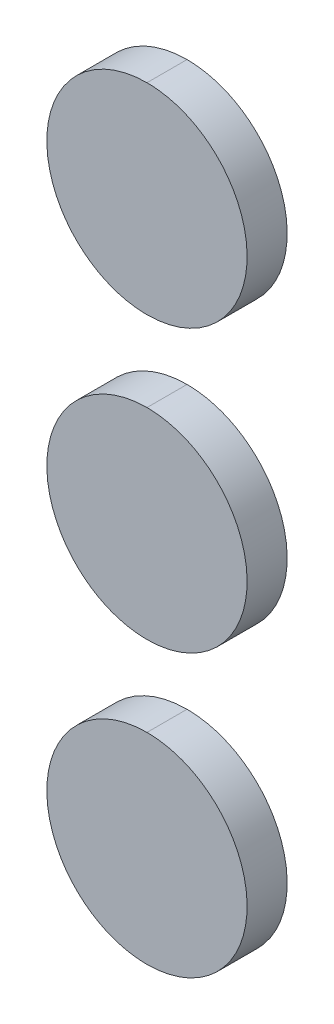
ISO-10303-21;
HEADER;
FILE_DESCRIPTION(('STEP AP214'),'2;1');
FILE_NAME('part.step','',(''),(''),'','','');
FILE_SCHEMA(('AUTOMOTIVE_DESIGN { 1 0 10303 214 1 1 1 1 }'));
ENDSEC;
DATA;
#1=APPLICATION_CONTEXT('core data for automotive mechanical design processes');
#2=APPLICATION_PROTOCOL_DEFINITION('international standard','automotive_design',2000,#1);
#3=PRODUCT_CONTEXT('',#1,'mechanical');
#4=PRODUCT('Part','Part','',(#3));
#5=PRODUCT_RELATED_PRODUCT_CATEGORY('part','',(#4));
#6=PRODUCT_DEFINITION_FORMATION('','',#4);
#7=PRODUCT_DEFINITION_CONTEXT('part definition',#1,'design');
#8=PRODUCT_DEFINITION('design','',#6,#7);
#9=PRODUCT_DEFINITION_SHAPE('','',#8);
#10=(LENGTH_UNIT() NAMED_UNIT(*) SI_UNIT(.MILLI.,.METRE.));
#11=(NAMED_UNIT(*) PLANE_ANGLE_UNIT() SI_UNIT($,.RADIAN.));
#12=(NAMED_UNIT(*) SI_UNIT($,.STERADIAN.) SOLID_ANGLE_UNIT());
#13=UNCERTAINTY_MEASURE_WITH_UNIT(LENGTH_MEASURE(1.E-05),#10,'distance_accuracy_value','');
#14=(GEOMETRIC_REPRESENTATION_CONTEXT(3) GLOBAL_UNCERTAINTY_ASSIGNED_CONTEXT((#13)) GLOBAL_UNIT_ASSIGNED_CONTEXT((#10,
#11,#12)) REPRESENTATION_CONTEXT('',''));
#15=CARTESIAN_POINT('',(0.,0.,0.));
#16=DIRECTION('',(0.,0.,1.));
#17=DIRECTION('',(1.,0.,0.));
#18=AXIS2_PLACEMENT_3D('',#15,#16,#17);
#19=CARTESIAN_POINT('',(43.9,55.4966699303325,0.5));
#20=CARTESIAN_POINT('',(43.9,55.4966699303325,0.));
#21=CARTESIAN_POINT('',(41.4,55.4966699303325,0.499999999999999));
#22=CARTESIAN_POINT('',(41.4,55.4966699303325,0.));
#23=CARTESIAN_POINT('',(41.4,52.9880043930841,0.499999999999999));
#24=CARTESIAN_POINT('',(41.4,52.9880043930841,0.));
#25=CARTESIAN_POINT('',(43.9,52.9880043930841,0.5));
#26=CARTESIAN_POINT('',(43.9,52.9880043930841,0.));
#27=(BOUNDED_SURFACE() B_SPLINE_SURFACE(3,1,((#19,#20),(#21,#22),(#23,#24),(#25,#26)),
.UNSPECIFIED.,.F.,.F.,.F.) B_SPLINE_SURFACE_WITH_KNOTS((4,4),(2,2),(0.,1.),(0.,1.),
.UNSPECIFIED.) GEOMETRIC_REPRESENTATION_ITEM() RATIONAL_B_SPLINE_SURFACE(((1.,1.),
(0.333333333333334,0.333333333333334),(0.333333333333334,0.333333333333334),(1.,1.))) REPRESENTATION_ITEM('') SURFACE());
#28=CARTESIAN_POINT('',(43.9,55.4966699303325,0.5));
#29=CARTESIAN_POINT('',(41.4,55.4966699303325,0.499999999999999));
#30=CARTESIAN_POINT('',(41.4,52.9880043930841,0.499999999999999));
#31=CARTESIAN_POINT('',(43.9,52.9880043930841,0.5));
#32=(BOUNDED_CURVE() B_SPLINE_CURVE(3,(#28,#29,#30,#31),.UNSPECIFIED.,.F.,
.F.) B_SPLINE_CURVE_WITH_KNOTS((4,4),(3.1415926535898,6.28318530717959),
.UNSPECIFIED.) CURVE() GEOMETRIC_REPRESENTATION_ITEM() RATIONAL_B_SPLINE_CURVE((1.,
0.333333333333334,0.333333333333334,1.)) REPRESENTATION_ITEM(''));
#33=CARTESIAN_POINT('',(43.9,55.4966699303325,0.5));
#34=VERTEX_POINT('',#33);
#35=CARTESIAN_POINT('',(43.9,52.9880043930841,0.5));
#36=VERTEX_POINT('',#35);
#37=EDGE_CURVE('P0_E43',#34,#36,#32,.T.);
#38=DIRECTION('',(0.,0.,-1.));
#39=VECTOR('',#38,1.);
#40=CARTESIAN_POINT('',(43.9,55.4966699303325,0.5));
#41=LINE('',#40,#39);
#42=CARTESIAN_POINT('',(43.9,55.4966699303325,0.));
#43=VERTEX_POINT('',#42);
#44=EDGE_CURVE('P0_E11',#34,#43,#41,.T.);
#45=CARTESIAN_POINT('',(43.9,55.4966699303325,0.));
#46=CARTESIAN_POINT('',(41.4,55.4966699303325,0.));
#47=CARTESIAN_POINT('',(41.4,52.9880043930841,0.));
#48=CARTESIAN_POINT('',(43.9,52.9880043930841,0.));
#49=(BOUNDED_CURVE() B_SPLINE_CURVE(3,(#45,#46,#47,#48),.UNSPECIFIED.,.F.,
.F.) B_SPLINE_CURVE_WITH_KNOTS((4,4),(3.1415926535898,6.28318530717959),
.UNSPECIFIED.) CURVE() GEOMETRIC_REPRESENTATION_ITEM() RATIONAL_B_SPLINE_CURVE((1.,
0.333333333333334,0.333333333333334,1.)) REPRESENTATION_ITEM(''));
#50=CARTESIAN_POINT('',(43.9,52.9880043930841,0.));
#51=VERTEX_POINT('',#50);
#52=EDGE_CURVE('P0_E30',#43,#51,#49,.T.);
#53=DIRECTION('',(0.,0.,-1.));
#54=VECTOR('',#53,1.);
#55=CARTESIAN_POINT('',(43.9,52.9880043930841,0.5));
#56=LINE('',#55,#54);
#57=EDGE_CURVE('P0_E56',#36,#51,#56,.T.);
#58=ORIENTED_EDGE('',*,*,#37,.F.);
#59=ORIENTED_EDGE('',*,*,#44,.T.);
#60=ORIENTED_EDGE('',*,*,#52,.T.);
#61=ORIENTED_EDGE('',*,*,#57,.F.);
#62=EDGE_LOOP('',(#58,#59,#60,#61));
#63=FACE_BOUND('',#62,.T.);
#64=ADVANCED_FACE('P0_F16',(#63),#27,.F.);
#65=CARTESIAN_POINT('',(43.9,52.9880043930841,0.5));
#66=CARTESIAN_POINT('',(43.9,52.9880043930841,0.));
#67=CARTESIAN_POINT('',(46.3999999999999,52.9880043930841,0.499999999999999));
#68=CARTESIAN_POINT('',(46.3999999999999,52.9880043930841,0.));
#69=CARTESIAN_POINT('',(46.3999999999999,55.4966699303325,0.499999999999999));
#70=CARTESIAN_POINT('',(46.3999999999999,55.4966699303325,0.));
#71=CARTESIAN_POINT('',(43.9,55.4966699303325,0.5));
#72=CARTESIAN_POINT('',(43.9,55.4966699303325,0.));
#73=(BOUNDED_SURFACE() B_SPLINE_SURFACE(3,1,((#65,#66),(#67,#68),(#69,#70),(#71,#72)),
.UNSPECIFIED.,.F.,.F.,.F.) B_SPLINE_SURFACE_WITH_KNOTS((4,4),(2,2),(0.,1.),(0.,1.),
.UNSPECIFIED.) GEOMETRIC_REPRESENTATION_ITEM() RATIONAL_B_SPLINE_SURFACE(((1.,1.),
(0.333333333333334,0.333333333333334),(0.333333333333334,0.333333333333334),(1.,1.))) REPRESENTATION_ITEM('') SURFACE());
#74=CARTESIAN_POINT('',(43.9,52.9880043930841,0.5));
#75=CARTESIAN_POINT('',(46.3999999999999,52.9880043930841,0.499999999999999));
#76=CARTESIAN_POINT('',(46.3999999999999,55.4966699303325,0.499999999999999));
#77=CARTESIAN_POINT('',(43.9,55.4966699303325,0.5));
#78=(BOUNDED_CURVE() B_SPLINE_CURVE(3,(#74,#75,#76,#77),.UNSPECIFIED.,.F.,
.F.) B_SPLINE_CURVE_WITH_KNOTS((4,4),(0.,3.1415926535898),
.UNSPECIFIED.) CURVE() GEOMETRIC_REPRESENTATION_ITEM() RATIONAL_B_SPLINE_CURVE((1.,
0.333333333333334,0.333333333333334,1.)) REPRESENTATION_ITEM(''));
#79=EDGE_CURVE('P0_E64',#36,#34,#78,.T.);
#80=CARTESIAN_POINT('',(43.9,52.9880043930841,0.));
#81=CARTESIAN_POINT('',(46.3999999999999,52.9880043930841,0.));
#82=CARTESIAN_POINT('',(46.3999999999999,55.4966699303325,0.));
#83=CARTESIAN_POINT('',(43.9,55.4966699303325,0.));
#84=(BOUNDED_CURVE() B_SPLINE_CURVE(3,(#80,#81,#82,#83),.UNSPECIFIED.,.F.,
.F.) B_SPLINE_CURVE_WITH_KNOTS((4,4),(0.,3.1415926535898),
.UNSPECIFIED.) CURVE() GEOMETRIC_REPRESENTATION_ITEM() RATIONAL_B_SPLINE_CURVE((1.,
0.333333333333334,0.333333333333334,1.)) REPRESENTATION_ITEM(''));
#85=EDGE_CURVE('P0_E21',#51,#43,#84,.T.);
#86=ORIENTED_EDGE('',*,*,#44,.F.);
#87=ORIENTED_EDGE('',*,*,#79,.F.);
#88=ORIENTED_EDGE('',*,*,#57,.T.);
#89=ORIENTED_EDGE('',*,*,#85,.T.);
#90=EDGE_LOOP('',(#86,#87,#88,#89));
#91=FACE_BOUND('',#90,.T.);
#92=ADVANCED_FACE('P0_F69',(#91),#73,.F.);
#93=CARTESIAN_POINT('',(43.9,54.2423371617083,0.5));
#94=DIRECTION('',(0.,0.,1.));
#95=DIRECTION('',(1.,0.,0.));
#96=AXIS2_PLACEMENT_3D('',#93,#94,#95);
#97=PLANE('',#96);
#98=ORIENTED_EDGE('',*,*,#79,.T.);
#99=ORIENTED_EDGE('',*,*,#37,.T.);
#100=EDGE_LOOP('',(#98,#99));
#101=FACE_BOUND('',#100,.T.);
#102=ADVANCED_FACE('P0_F63',(#101),#97,.T.);
#103=CARTESIAN_POINT('',(43.9,54.2423371617083,0.));
#104=DIRECTION('',(0.,0.,1.));
#105=DIRECTION('',(1.,0.,0.));
#106=AXIS2_PLACEMENT_3D('',#103,#104,#105);
#107=PLANE('',#106);
#108=ORIENTED_EDGE('',*,*,#85,.F.);
#109=ORIENTED_EDGE('',*,*,#52,.F.);
#110=EDGE_LOOP('',(#108,#109));
#111=FACE_BOUND('',#110,.T.);
#112=ADVANCED_FACE('P0_F122',(#111),#107,.F.);
#113=CLOSED_SHELL('',(#64,#92,#102,#112));
#114=MANIFOLD_SOLID_BREP('P0_B1',#113);
#115=CARTESIAN_POINT('',(43.9,59.0088016824803,0.5));
#116=CARTESIAN_POINT('',(43.9,59.0088016824803,0.));
#117=CARTESIAN_POINT('',(41.4,59.0088016824802,0.499999999999999));
#118=CARTESIAN_POINT('',(41.4,59.0088016824802,0.));
#119=CARTESIAN_POINT('',(41.4,56.5001361452319,0.499999999999999));
#120=CARTESIAN_POINT('',(41.4,56.5001361452319,0.));
#121=CARTESIAN_POINT('',(43.9,56.5001361452319,0.5));
#122=CARTESIAN_POINT('',(43.9,56.5001361452319,0.));
#123=(BOUNDED_SURFACE() B_SPLINE_SURFACE(3,1,((#115,#116),(#117,#118),(#119,#120),(#121,#122)),
.UNSPECIFIED.,.F.,.F.,.F.) B_SPLINE_SURFACE_WITH_KNOTS((4,4),(2,2),(0.,1.),(0.,1.),
.UNSPECIFIED.) GEOMETRIC_REPRESENTATION_ITEM() RATIONAL_B_SPLINE_SURFACE(((1.,1.),
(0.333333333333334,0.333333333333334),(0.333333333333334,0.333333333333334),(1.,1.))) REPRESENTATION_ITEM('') SURFACE());
#124=CARTESIAN_POINT('',(43.9,59.0088016824803,0.5));
#125=CARTESIAN_POINT('',(41.4,59.0088016824802,0.499999999999999));
#126=CARTESIAN_POINT('',(41.4,56.5001361452319,0.499999999999999));
#127=CARTESIAN_POINT('',(43.9,56.5001361452319,0.5));
#128=(BOUNDED_CURVE() B_SPLINE_CURVE(3,(#124,#125,#126,#127),.UNSPECIFIED.,.F.,
.F.) B_SPLINE_CURVE_WITH_KNOTS((4,4),(3.1415926535898,6.28318530717959),
.UNSPECIFIED.) CURVE() GEOMETRIC_REPRESENTATION_ITEM() RATIONAL_B_SPLINE_CURVE((1.,
0.333333333333334,0.333333333333334,1.)) REPRESENTATION_ITEM(''));
#129=CARTESIAN_POINT('',(43.9,59.0088016824803,0.5));
#130=VERTEX_POINT('',#129);
#131=CARTESIAN_POINT('',(43.9,56.5001361452319,0.5));
#132=VERTEX_POINT('',#131);
#133=EDGE_CURVE('P1_E39',#130,#132,#128,.T.);
#134=DIRECTION('',(0.,0.,-1.));
#135=VECTOR('',#134,1.);
#136=CARTESIAN_POINT('',(43.9,59.0088016824803,0.5));
#137=LINE('',#136,#135);
#138=CARTESIAN_POINT('',(43.9,59.0088016824803,0.));
#139=VERTEX_POINT('',#138);
#140=EDGE_CURVE('P1_E11',#130,#139,#137,.T.);
#141=CARTESIAN_POINT('',(43.9,59.0088016824803,0.));
#142=CARTESIAN_POINT('',(41.4,59.0088016824802,0.));
#143=CARTESIAN_POINT('',(41.4,56.5001361452319,0.));
#144=CARTESIAN_POINT('',(43.9,56.5001361452319,0.));
#145=(BOUNDED_CURVE() B_SPLINE_CURVE(3,(#141,#142,#143,#144),.UNSPECIFIED.,.F.,
.F.) B_SPLINE_CURVE_WITH_KNOTS((4,4),(3.1415926535898,6.28318530717959),
.UNSPECIFIED.) CURVE() GEOMETRIC_REPRESENTATION_ITEM() RATIONAL_B_SPLINE_CURVE((1.,
0.333333333333334,0.333333333333334,1.)) REPRESENTATION_ITEM(''));
#146=CARTESIAN_POINT('',(43.9,56.5001361452319,0.));
#147=VERTEX_POINT('',#146);
#148=EDGE_CURVE('P1_E27',#139,#147,#145,.T.);
#149=DIRECTION('',(0.,0.,-1.));
#150=VECTOR('',#149,1.);
#151=CARTESIAN_POINT('',(43.9,56.5001361452319,0.5));
#152=LINE('',#151,#150);
#153=EDGE_CURVE('P1_E57',#132,#147,#152,.T.);
#154=ORIENTED_EDGE('',*,*,#133,.F.);
#155=ORIENTED_EDGE('',*,*,#140,.T.);
#156=ORIENTED_EDGE('',*,*,#148,.T.);
#157=ORIENTED_EDGE('',*,*,#153,.F.);
#158=EDGE_LOOP('',(#154,#155,#156,#157));
#159=FACE_BOUND('',#158,.T.);
#160=ADVANCED_FACE('P1_F16',(#159),#123,.F.);
#161=CARTESIAN_POINT('',(43.9,56.5001361452319,0.5));
#162=CARTESIAN_POINT('',(43.9,56.5001361452319,0.));
#163=CARTESIAN_POINT('',(46.3999999999999,56.5001361452319,0.499999999999999));
#164=CARTESIAN_POINT('',(46.3999999999999,56.5001361452319,0.));
#165=CARTESIAN_POINT('',(46.3999999999999,59.0088016824802,0.499999999999999));
#166=CARTESIAN_POINT('',(46.3999999999999,59.0088016824802,0.));
#167=CARTESIAN_POINT('',(43.9,59.0088016824803,0.5));
#168=CARTESIAN_POINT('',(43.9,59.0088016824803,0.));
#169=(BOUNDED_SURFACE() B_SPLINE_SURFACE(3,1,((#161,#162),(#163,#164),(#165,#166),(#167,#168)),
.UNSPECIFIED.,.F.,.F.,.F.) B_SPLINE_SURFACE_WITH_KNOTS((4,4),(2,2),(0.,1.),(0.,1.),
.UNSPECIFIED.) GEOMETRIC_REPRESENTATION_ITEM() RATIONAL_B_SPLINE_SURFACE(((1.,1.),
(0.333333333333334,0.333333333333334),(0.333333333333334,0.333333333333334),(1.,1.))) REPRESENTATION_ITEM('') SURFACE());
#170=CARTESIAN_POINT('',(43.9,56.5001361452319,0.5));
#171=CARTESIAN_POINT('',(46.3999999999999,56.5001361452319,0.499999999999999));
#172=CARTESIAN_POINT('',(46.3999999999999,59.0088016824802,0.499999999999999));
#173=CARTESIAN_POINT('',(43.9,59.0088016824803,0.5));
#174=(BOUNDED_CURVE() B_SPLINE_CURVE(3,(#170,#171,#172,#173),.UNSPECIFIED.,.F.,
.F.) B_SPLINE_CURVE_WITH_KNOTS((4,4),(0.,3.1415926535898),
.UNSPECIFIED.) CURVE() GEOMETRIC_REPRESENTATION_ITEM() RATIONAL_B_SPLINE_CURVE((1.,
0.333333333333334,0.333333333333334,1.)) REPRESENTATION_ITEM(''));
#175=EDGE_CURVE('P1_E62',#132,#130,#174,.T.);
#176=CARTESIAN_POINT('',(43.9,56.5001361452319,0.));
#177=CARTESIAN_POINT('',(46.3999999999999,56.5001361452319,0.));
#178=CARTESIAN_POINT('',(46.3999999999999,59.0088016824802,0.));
#179=CARTESIAN_POINT('',(43.9,59.0088016824803,0.));
#180=(BOUNDED_CURVE() B_SPLINE_CURVE(3,(#176,#177,#178,#179),.UNSPECIFIED.,.F.,
.F.) B_SPLINE_CURVE_WITH_KNOTS((4,4),(0.,3.1415926535898),
.UNSPECIFIED.) CURVE() GEOMETRIC_REPRESENTATION_ITEM() RATIONAL_B_SPLINE_CURVE((1.,
0.333333333333334,0.333333333333334,1.)) REPRESENTATION_ITEM(''));
#181=EDGE_CURVE('P1_E61',#147,#139,#180,.T.);
#182=ORIENTED_EDGE('',*,*,#140,.F.);
#183=ORIENTED_EDGE('',*,*,#175,.F.);
#184=ORIENTED_EDGE('',*,*,#153,.T.);
#185=ORIENTED_EDGE('',*,*,#181,.T.);
#186=EDGE_LOOP('',(#182,#183,#184,#185));
#187=FACE_BOUND('',#186,.T.);
#188=ADVANCED_FACE('P1_F59',(#187),#169,.F.);
#189=CARTESIAN_POINT('',(43.9,57.7544689138561,0.5));
#190=DIRECTION('',(0.,0.,1.));
#191=DIRECTION('',(1.,0.,0.));
#192=AXIS2_PLACEMENT_3D('',#189,#190,#191);
#193=PLANE('',#192);
#194=ORIENTED_EDGE('',*,*,#175,.T.);
#195=ORIENTED_EDGE('',*,*,#133,.T.);
#196=EDGE_LOOP('',(#194,#195));
#197=FACE_BOUND('',#196,.T.);
#198=ADVANCED_FACE('P1_F126',(#197),#193,.T.);
#199=CARTESIAN_POINT('',(43.9,57.7544689138561,0.));
#200=DIRECTION('',(0.,0.,1.));
#201=DIRECTION('',(1.,0.,0.));
#202=AXIS2_PLACEMENT_3D('',#199,#200,#201);
#203=PLANE('',#202);
#204=ORIENTED_EDGE('',*,*,#181,.F.);
#205=ORIENTED_EDGE('',*,*,#148,.F.);
#206=EDGE_LOOP('',(#204,#205));
#207=FACE_BOUND('',#206,.T.);
#208=ADVANCED_FACE('P1_F68',(#207),#203,.F.);
#209=CLOSED_SHELL('',(#160,#188,#198,#208));
#210=MANIFOLD_SOLID_BREP('P1_B1',#209);
#211=CARTESIAN_POINT('',(43.9,62.520933434628,0.5));
#212=CARTESIAN_POINT('',(43.9,62.520933434628,0.));
#213=CARTESIAN_POINT('',(41.4,62.520933434628,0.499999999999999));
#214=CARTESIAN_POINT('',(41.4,62.520933434628,0.));
#215=CARTESIAN_POINT('',(41.4,60.0122678973796,0.499999999999999));
#216=CARTESIAN_POINT('',(41.4,60.0122678973796,0.));
#217=CARTESIAN_POINT('',(43.9,60.0122678973796,0.5));
#218=CARTESIAN_POINT('',(43.9,60.0122678973796,0.));
#219=(BOUNDED_SURFACE() B_SPLINE_SURFACE(3,1,((#211,#212),(#213,#214),(#215,#216),(#217,#218)),
.UNSPECIFIED.,.F.,.F.,.F.) B_SPLINE_SURFACE_WITH_KNOTS((4,4),(2,2),(0.,1.),(0.,1.),
.UNSPECIFIED.) GEOMETRIC_REPRESENTATION_ITEM() RATIONAL_B_SPLINE_SURFACE(((1.,1.),
(0.333333333333334,0.333333333333334),(0.333333333333334,0.333333333333334),(1.,1.))) REPRESENTATION_ITEM('') SURFACE());
#220=CARTESIAN_POINT('',(43.9,62.520933434628,0.5));
#221=CARTESIAN_POINT('',(41.4,62.520933434628,0.499999999999999));
#222=CARTESIAN_POINT('',(41.4,60.0122678973796,0.499999999999999));
#223=CARTESIAN_POINT('',(43.9,60.0122678973796,0.5));
#224=(BOUNDED_CURVE() B_SPLINE_CURVE(3,(#220,#221,#222,#223),.UNSPECIFIED.,.F.,
.F.) B_SPLINE_CURVE_WITH_KNOTS((4,4),(3.1415926535898,6.28318530717959),
.UNSPECIFIED.) CURVE() GEOMETRIC_REPRESENTATION_ITEM() RATIONAL_B_SPLINE_CURVE((1.,
0.333333333333334,0.333333333333334,1.)) REPRESENTATION_ITEM(''));
#225=CARTESIAN_POINT('',(43.9,62.520933434628,0.5));
#226=VERTEX_POINT('',#225);
#227=CARTESIAN_POINT('',(43.9,60.0122678973796,0.5));
#228=VERTEX_POINT('',#227);
#229=EDGE_CURVE('P2_E20',#226,#228,#224,.T.);
#230=DIRECTION('',(0.,0.,-1.));
#231=VECTOR('',#230,1.);
#232=CARTESIAN_POINT('',(43.9,62.520933434628,0.5));
#233=LINE('',#232,#231);
#234=CARTESIAN_POINT('',(43.9,62.520933434628,0.));
#235=VERTEX_POINT('',#234);
#236=EDGE_CURVE('P2_E11',#226,#235,#233,.T.);
#237=CARTESIAN_POINT('',(43.9,62.520933434628,0.));
#238=CARTESIAN_POINT('',(41.4,62.520933434628,0.));
#239=CARTESIAN_POINT('',(41.4,60.0122678973796,0.));
#240=CARTESIAN_POINT('',(43.9,60.0122678973796,0.));
#241=(BOUNDED_CURVE() B_SPLINE_CURVE(3,(#237,#238,#239,#240),.UNSPECIFIED.,.F.,
.F.) B_SPLINE_CURVE_WITH_KNOTS((4,4),(3.1415926535898,6.28318530717959),
.UNSPECIFIED.) CURVE() GEOMETRIC_REPRESENTATION_ITEM() RATIONAL_B_SPLINE_CURVE((1.,
0.333333333333334,0.333333333333334,1.)) REPRESENTATION_ITEM(''));
#242=CARTESIAN_POINT('',(43.9,60.0122678973796,0.));
#243=VERTEX_POINT('',#242);
#244=EDGE_CURVE('P2_E29',#235,#243,#241,.T.);
#245=DIRECTION('',(0.,0.,-1.));
#246=VECTOR('',#245,1.);
#247=CARTESIAN_POINT('',(43.9,60.0122678973796,0.5));
#248=LINE('',#247,#246);
#249=EDGE_CURVE('P2_E60',#228,#243,#248,.T.);
#250=ORIENTED_EDGE('',*,*,#229,.F.);
#251=ORIENTED_EDGE('',*,*,#236,.T.);
#252=ORIENTED_EDGE('',*,*,#244,.T.);
#253=ORIENTED_EDGE('',*,*,#249,.F.);
#254=EDGE_LOOP('',(#250,#251,#252,#253));
#255=FACE_BOUND('',#254,.T.);
#256=ADVANCED_FACE('P2_F16',(#255),#219,.F.);
#257=CARTESIAN_POINT('',(43.9,60.0122678973796,0.5));
#258=CARTESIAN_POINT('',(43.9,60.0122678973796,0.));
#259=CARTESIAN_POINT('',(46.3999999999999,60.0122678973796,0.499999999999999));
#260=CARTESIAN_POINT('',(46.3999999999999,60.0122678973796,0.));
#261=CARTESIAN_POINT('',(46.3999999999999,62.520933434628,0.499999999999999));
#262=CARTESIAN_POINT('',(46.3999999999999,62.520933434628,0.));
#263=CARTESIAN_POINT('',(43.9,62.520933434628,0.5));
#264=CARTESIAN_POINT('',(43.9,62.520933434628,0.));
#265=(BOUNDED_SURFACE() B_SPLINE_SURFACE(3,1,((#257,#258),(#259,#260),(#261,#262),(#263,#264)),
.UNSPECIFIED.,.F.,.F.,.F.) B_SPLINE_SURFACE_WITH_KNOTS((4,4),(2,2),(0.,1.),(0.,1.),
.UNSPECIFIED.) GEOMETRIC_REPRESENTATION_ITEM() RATIONAL_B_SPLINE_SURFACE(((1.,1.),
(0.333333333333334,0.333333333333334),(0.333333333333334,0.333333333333334),(1.,1.))) REPRESENTATION_ITEM('') SURFACE());
#266=CARTESIAN_POINT('',(43.9,60.0122678973796,0.5));
#267=CARTESIAN_POINT('',(46.3999999999999,60.0122678973796,0.499999999999999));
#268=CARTESIAN_POINT('',(46.3999999999999,62.520933434628,0.499999999999999));
#269=CARTESIAN_POINT('',(43.9,62.520933434628,0.5));
#270=(BOUNDED_CURVE() B_SPLINE_CURVE(3,(#266,#267,#268,#269),.UNSPECIFIED.,.F.,
.F.) B_SPLINE_CURVE_WITH_KNOTS((4,4),(0.,3.1415926535898),
.UNSPECIFIED.) CURVE() GEOMETRIC_REPRESENTATION_ITEM() RATIONAL_B_SPLINE_CURVE((1.,
0.333333333333334,0.333333333333334,1.)) REPRESENTATION_ITEM(''));
#271=EDGE_CURVE('P2_E65',#228,#226,#270,.T.);
#272=CARTESIAN_POINT('',(43.9,60.0122678973796,0.));
#273=CARTESIAN_POINT('',(46.3999999999999,60.0122678973796,0.));
#274=CARTESIAN_POINT('',(46.3999999999999,62.520933434628,0.));
#275=CARTESIAN_POINT('',(43.9,62.520933434628,0.));
#276=(BOUNDED_CURVE() B_SPLINE_CURVE(3,(#272,#273,#274,#275),.UNSPECIFIED.,.F.,
.F.) B_SPLINE_CURVE_WITH_KNOTS((4,4),(0.,3.1415926535898),
.UNSPECIFIED.) CURVE() GEOMETRIC_REPRESENTATION_ITEM() RATIONAL_B_SPLINE_CURVE((1.,
0.333333333333334,0.333333333333334,1.)) REPRESENTATION_ITEM(''));
#277=EDGE_CURVE('P2_E64',#243,#235,#276,.T.);
#278=ORIENTED_EDGE('',*,*,#236,.F.);
#279=ORIENTED_EDGE('',*,*,#271,.F.);
#280=ORIENTED_EDGE('',*,*,#249,.T.);
#281=ORIENTED_EDGE('',*,*,#277,.T.);
#282=EDGE_LOOP('',(#278,#279,#280,#281));
#283=FACE_BOUND('',#282,.T.);
#284=ADVANCED_FACE('P2_F62',(#283),#265,.F.);
#285=CARTESIAN_POINT('',(43.9,61.2666006660038,0.5));
#286=DIRECTION('',(0.,0.,1.));
#287=DIRECTION('',(1.,0.,0.));
#288=AXIS2_PLACEMENT_3D('',#285,#286,#287);
#289=PLANE('',#288);
#290=ORIENTED_EDGE('',*,*,#271,.T.);
#291=ORIENTED_EDGE('',*,*,#229,.T.);
#292=EDGE_LOOP('',(#290,#291));
#293=FACE_BOUND('',#292,.T.);
#294=ADVANCED_FACE('P2_F110',(#293),#289,.T.);
#295=CARTESIAN_POINT('',(43.9,61.2666006660038,0.));
#296=DIRECTION('',(0.,0.,1.));
#297=DIRECTION('',(1.,0.,0.));
#298=AXIS2_PLACEMENT_3D('',#295,#296,#297);
#299=PLANE('',#298);
#300=ORIENTED_EDGE('',*,*,#277,.F.);
#301=ORIENTED_EDGE('',*,*,#244,.F.);
#302=EDGE_LOOP('',(#300,#301));
#303=FACE_BOUND('',#302,.T.);
#304=ADVANCED_FACE('P2_F18',(#303),#299,.F.);
#305=CLOSED_SHELL('',(#256,#284,#294,#304));
#306=MANIFOLD_SOLID_BREP('P2_B1',#305);
#307=ADVANCED_BREP_SHAPE_REPRESENTATION('',(#18,#114,#210,#306),#14);
#308=SHAPE_DEFINITION_REPRESENTATION(#9,#307);
ENDSEC;
END-ISO-10303-21;
